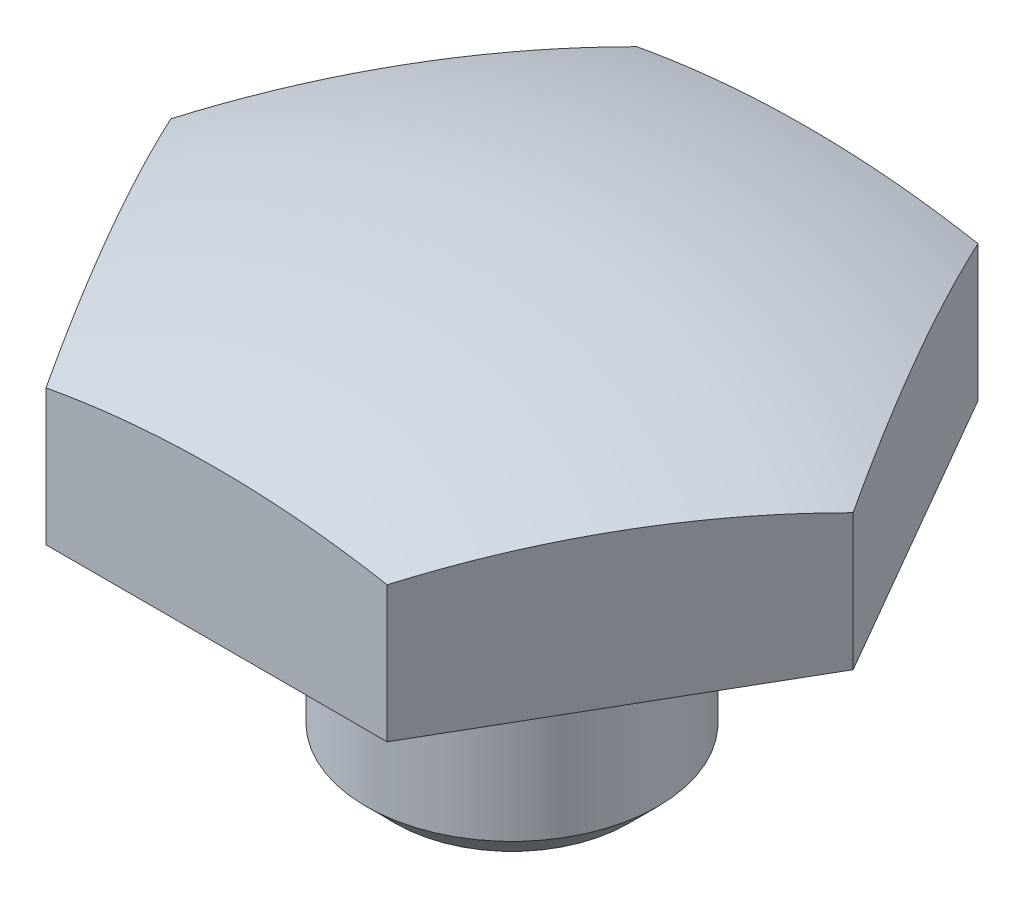
ISO-10303-21;
HEADER;
FILE_DESCRIPTION(('STEP AP214'),'2;1');
FILE_NAME('part.step','',(''),(''),'','','');
FILE_SCHEMA(('AUTOMOTIVE_DESIGN { 1 0 10303 214 1 1 1 1 }'));
ENDSEC;
DATA;
#1=APPLICATION_CONTEXT('core data for automotive mechanical design processes');
#2=APPLICATION_PROTOCOL_DEFINITION('international standard','automotive_design',2000,#1);
#3=PRODUCT_CONTEXT('',#1,'mechanical');
#4=PRODUCT('Part','Part','',(#3));
#5=PRODUCT_RELATED_PRODUCT_CATEGORY('part','',(#4));
#6=PRODUCT_DEFINITION_FORMATION('','',#4);
#7=PRODUCT_DEFINITION_CONTEXT('part definition',#1,'design');
#8=PRODUCT_DEFINITION('design','',#6,#7);
#9=PRODUCT_DEFINITION_SHAPE('','',#8);
#10=(LENGTH_UNIT() NAMED_UNIT(*) SI_UNIT(.MILLI.,.METRE.));
#11=(NAMED_UNIT(*) PLANE_ANGLE_UNIT() SI_UNIT($,.RADIAN.));
#12=(NAMED_UNIT(*) SI_UNIT($,.STERADIAN.) SOLID_ANGLE_UNIT());
#13=UNCERTAINTY_MEASURE_WITH_UNIT(LENGTH_MEASURE(1.E-05),#10,'distance_accuracy_value','');
#14=(GEOMETRIC_REPRESENTATION_CONTEXT(3) GLOBAL_UNCERTAINTY_ASSIGNED_CONTEXT((#13)) GLOBAL_UNIT_ASSIGNED_CONTEXT((#10,
#11,#12)) REPRESENTATION_CONTEXT('',''));
#15=CARTESIAN_POINT('',(0.,0.,0.));
#16=DIRECTION('',(0.,0.,1.));
#17=DIRECTION('',(1.,0.,0.));
#18=AXIS2_PLACEMENT_3D('',#15,#16,#17);
#19=CARTESIAN_POINT('',(0.,-17.4752,0.));
#20=DIRECTION('',(0.,-1.,0.));
#21=DIRECTION('',(1.,0.,0.));
#22=AXIS2_PLACEMENT_3D('',#19,#20,#21);
#23=SPHERICAL_SURFACE('',#22,31.75);
#24=CARTESIAN_POINT('',(-8.24889197104677,-17.4752,-4.7625));
#25=DIRECTION('',(0.866025403784438,0.,0.5));
#26=DIRECTION('',(0.5,0.,-0.866025403784439));
#27=AXIS2_PLACEMENT_3D('',#24,#25,#26);
#28=CIRCLE('',#27,30.287569644988);
#29=CARTESIAN_POINT('',(-10.9985226280624,12.3089410217097,0.));
#30=VERTEX_POINT('',#29);
#31=CARTESIAN_POINT('',(-5.49925618596528,12.3089410217097,-9.525));
#32=VERTEX_POINT('',#31);
#33=EDGE_CURVE('E106',#30,#32,#28,.F.);
#34=ORIENTED_EDGE('',*,*,#33,.F.);
#35=CARTESIAN_POINT('',(-8.24889197104677,-17.4752,4.7625));
#36=DIRECTION('',(0.866025403784438,0.,-0.5));
#37=DIRECTION('',(-0.5,0.,-0.866025403784439));
#38=AXIS2_PLACEMENT_3D('',#35,#36,#37);
#39=CIRCLE('',#38,30.287569644988);
#40=CARTESIAN_POINT('',(-5.49925618596528,12.3089419685407,9.525));
#41=VERTEX_POINT('',#40);
#42=EDGE_CURVE('E117',#41,#30,#39,.F.);
#43=ORIENTED_EDGE('',*,*,#42,.F.);
#44=CARTESIAN_POINT('',(0.,-17.4752,9.525));
#45=DIRECTION('',(0.,0.,-1.));
#46=DIRECTION('',(-1.,0.,0.));
#47=AXIS2_PLACEMENT_3D('',#44,#45,#46);
#48=CIRCLE('',#47,30.287569644988);
#49=CARTESIAN_POINT('',(5.49925618596535,12.3089410217098,9.525));
#50=VERTEX_POINT('',#49);
#51=EDGE_CURVE('E128',#50,#41,#48,.F.);
#52=ORIENTED_EDGE('',*,*,#51,.F.);
#53=CARTESIAN_POINT('',(8.24889197104678,-17.4752,4.7625));
#54=DIRECTION('',(-0.866025403784439,0.,-0.5));
#55=DIRECTION('',(-0.5,0.,0.866025403784439));
#56=AXIS2_PLACEMENT_3D('',#53,#54,#55);
#57=CIRCLE('',#56,30.287569644988);
#58=CARTESIAN_POINT('',(10.9985200640294,12.3089410217097,4.44103233875059E-06));
#59=VERTEX_POINT('',#58);
#60=EDGE_CURVE('E65',#59,#50,#57,.F.);
#61=ORIENTED_EDGE('',*,*,#60,.F.);
#62=CARTESIAN_POINT('',(8.24889197104678,-17.4752,-4.7625));
#63=DIRECTION('',(-0.866025403784438,0.,0.5));
#64=DIRECTION('',(0.5,0.,0.866025403784439));
#65=AXIS2_PLACEMENT_3D('',#62,#63,#64);
#66=CIRCLE('',#65,30.287569644988);
#67=CARTESIAN_POINT('',(5.49926387806151,12.3089410217097,-9.52499555896615));
#68=VERTEX_POINT('',#67);
#69=EDGE_CURVE('E222',#68,#59,#66,.F.);
#70=ORIENTED_EDGE('',*,*,#69,.F.);
#71=CARTESIAN_POINT('',(0.,-17.4752,-9.525));
#72=DIRECTION('',(0.,0.,1.));
#73=DIRECTION('',(1.,0.,0.));
#74=AXIS2_PLACEMENT_3D('',#71,#72,#73);
#75=CIRCLE('',#74,30.287569644988);
#76=EDGE_CURVE('E120',#32,#68,#75,.F.);
#77=ORIENTED_EDGE('',*,*,#76,.F.);
#78=EDGE_LOOP('',(#34,#43,#52,#61,#70,#77));
#79=FACE_BOUND('',#78,.T.);
#80=ADVANCED_FACE('F49',(#79),#23,.T.);
#81=CARTESIAN_POINT('',(0.,0.,0.));
#82=DIRECTION('',(0.,-1.,0.));
#83=DIRECTION('',(1.,0.,0.));
#84=AXIS2_PLACEMENT_3D('',#81,#82,#83);
#85=PLANE('',#84);
#86=CARTESIAN_POINT('',(0.,0.,0.));
#87=DIRECTION('',(0.,-1.,0.));
#88=DIRECTION('',(1.,0.,0.));
#89=AXIS2_PLACEMENT_3D('',#86,#87,#88);
#90=CIRCLE('',#89,3.74650000000001);
#91=CARTESIAN_POINT('',(3.74650000000001,0.,0.));
#92=VERTEX_POINT('',#91);
#93=EDGE_CURVE('E246',#92,#92,#90,.T.);
#94=ORIENTED_EDGE('',*,*,#93,.T.);
#95=EDGE_LOOP('',(#94));
#96=FACE_BOUND('',#95,.T.);
#97=ADVANCED_FACE('F300',(#96),#85,.T.);
#98=CARTESIAN_POINT('',(0.,0.,0.));
#99=DIRECTION('',(0.,1.,0.));
#100=DIRECTION('',(-1.,0.,0.));
#101=AXIS2_PLACEMENT_3D('',#98,#99,#100);
#102=CONICAL_SURFACE('',#101,3.74650000000001,0.785398163397609);
#103=CARTESIAN_POINT('',(0.,0.95249999999969,0.));
#104=DIRECTION('',(0.,-1.,0.));
#105=DIRECTION('',(1.,0.,0.));
#106=AXIS2_PLACEMENT_3D('',#103,#104,#105);
#107=CIRCLE('',#106,4.699);
#108=CARTESIAN_POINT('',(4.699,0.952499999999706,0.));
#109=VERTEX_POINT('',#108);
#110=EDGE_CURVE('E243',#109,#109,#107,.T.);
#111=ORIENTED_EDGE('',*,*,#110,.T.);
#112=EDGE_LOOP('',(#111));
#113=FACE_BOUND('',#112,.T.);
#114=ORIENTED_EDGE('',*,*,#93,.F.);
#115=EDGE_LOOP('',(#114));
#116=FACE_BOUND('',#115,.T.);
#117=ADVANCED_FACE('F304',(#113,#116),#102,.T.);
#118=CARTESIAN_POINT('',(3.49148133884313E-12,-1000.,0.));
#119=DIRECTION('',(0.,-1.,0.));
#120=DIRECTION('',(1.,0.,0.));
#121=AXIS2_PLACEMENT_3D('',#118,#119,#120);
#122=CYLINDRICAL_SURFACE('',#121,4.69900000000001);
#123=CARTESIAN_POINT('',(0.,4.99110000000025,0.));
#124=DIRECTION('',(0.,-1.,0.));
#125=DIRECTION('',(1.,0.,0.));
#126=AXIS2_PLACEMENT_3D('',#123,#124,#125);
#127=CIRCLE('',#126,4.69900000000002);
#128=CARTESIAN_POINT('',(4.699,4.99110000000026,0.));
#129=VERTEX_POINT('',#128);
#130=EDGE_CURVE('E240',#129,#129,#127,.T.);
#131=ORIENTED_EDGE('',*,*,#130,.T.);
#132=EDGE_LOOP('',(#131));
#133=FACE_BOUND('',#132,.T.);
#134=ORIENTED_EDGE('',*,*,#110,.F.);
#135=EDGE_LOOP('',(#134));
#136=FACE_BOUND('',#135,.T.);
#137=ADVANCED_FACE('F308',(#133,#136),#122,.T.);
#138=CARTESIAN_POINT('',(0.,4.99110000000025,0.));
#139=DIRECTION('',(0.,-1.,0.));
#140=DIRECTION('',(1.,0.,0.));
#141=AXIS2_PLACEMENT_3D('',#138,#139,#140);
#142=CONICAL_SURFACE('',#141,4.69900000000002,0.78539816339761);
#143=CARTESIAN_POINT('',(0.,5.94359999999994,0.));
#144=DIRECTION('',(0.,-1.,0.));
#145=DIRECTION('',(1.,0.,0.));
#146=AXIS2_PLACEMENT_3D('',#143,#144,#145);
#147=CIRCLE('',#146,3.74650000000002);
#148=CARTESIAN_POINT('',(3.7465,5.94359999999995,0.));
#149=VERTEX_POINT('',#148);
#150=EDGE_CURVE('E231',#149,#149,#147,.T.);
#151=ORIENTED_EDGE('',*,*,#150,.T.);
#152=EDGE_LOOP('',(#151));
#153=FACE_BOUND('',#152,.T.);
#154=ORIENTED_EDGE('',*,*,#130,.F.);
#155=EDGE_LOOP('',(#154));
#156=FACE_BOUND('',#155,.T.);
#157=ADVANCED_FACE('F314',(#153,#156),#142,.T.);
#158=CARTESIAN_POINT('',(3.49148133884313E-12,-1000.,0.));
#159=DIRECTION('',(0.,-1.,0.));
#160=DIRECTION('',(1.,0.,0.));
#161=AXIS2_PLACEMENT_3D('',#158,#159,#160);
#162=CYLINDRICAL_SURFACE('',#161,3.74650000000002);
#163=CARTESIAN_POINT('',(0.,7.5438000000001,0.));
#164=DIRECTION('',(0.,-1.,0.));
#165=DIRECTION('',(1.,0.,0.));
#166=AXIS2_PLACEMENT_3D('',#163,#164,#165);
#167=CIRCLE('',#166,3.74650000000003);
#168=CARTESIAN_POINT('',(3.7465,7.54380000000011,0.));
#169=VERTEX_POINT('',#168);
#170=EDGE_CURVE('E226',#169,#169,#167,.T.);
#171=ORIENTED_EDGE('',*,*,#170,.T.);
#172=EDGE_LOOP('',(#171));
#173=FACE_BOUND('',#172,.T.);
#174=ORIENTED_EDGE('',*,*,#150,.F.);
#175=EDGE_LOOP('',(#174));
#176=FACE_BOUND('',#175,.T.);
#177=ADVANCED_FACE('F318',(#173,#176),#162,.T.);
#178=CARTESIAN_POINT('',(0.,7.5438,0.));
#179=DIRECTION('',(0.,-1.,0.));
#180=DIRECTION('',(1.,0.,0.));
#181=AXIS2_PLACEMENT_3D('',#178,#179,#180);
#182=TOROIDAL_SURFACE('',#181,4.12750000000003,0.381);
#183=CARTESIAN_POINT('',(0.,7.92480000000007,0.));
#184=DIRECTION('',(0.,-1.,0.));
#185=DIRECTION('',(1.,0.,0.));
#186=AXIS2_PLACEMENT_3D('',#183,#184,#185);
#187=CIRCLE('',#186,4.12750000000003);
#188=CARTESIAN_POINT('',(4.1275,7.92480000000008,0.));
#189=VERTEX_POINT('',#188);
#190=EDGE_CURVE('E224',#189,#189,#187,.T.);
#191=ORIENTED_EDGE('',*,*,#190,.T.);
#192=EDGE_LOOP('',(#191));
#193=FACE_BOUND('',#192,.T.);
#194=ORIENTED_EDGE('',*,*,#170,.F.);
#195=EDGE_LOOP('',(#194));
#196=FACE_BOUND('',#195,.T.);
#197=ADVANCED_FACE('F322',(#193,#196),#182,.F.);
#198=CARTESIAN_POINT('',(10.9985175,7.92480000000001,0.));
#199=DIRECTION('',(0.,-1.,0.));
#200=DIRECTION('',(1.,0.,0.));
#201=AXIS2_PLACEMENT_3D('',#198,#199,#200);
#202=PLANE('',#201);
#203=DIRECTION('',(-0.5,0.,0.866025403784439));
#204=VECTOR('',#203,1.);
#205=CARTESIAN_POINT('',(-5.49926259604677,7.92479999999996,-9.52499777948386));
#206=LINE('',#205,#204);
#207=CARTESIAN_POINT('',(-5.49926131403118,7.92479999999999,-9.525));
#208=VERTEX_POINT('',#207);
#209=CARTESIAN_POINT('',(-10.9985226280624,7.92480000000002,0.));
#210=VERTEX_POINT('',#209);
#211=EDGE_CURVE('E109',#208,#210,#206,.T.);
#212=ORIENTED_EDGE('',*,*,#211,.F.);
#213=DIRECTION('',(1.,0.,0.));
#214=VECTOR('',#213,1.);
#215=CARTESIAN_POINT('',(0.,7.92479999999999,-9.525));
#216=LINE('',#215,#214);
#217=CARTESIAN_POINT('',(5.49926131403119,7.92480000000001,-9.525));
#218=VERTEX_POINT('',#217);
#219=EDGE_CURVE('E259',#218,#208,#216,.F.);
#220=ORIENTED_EDGE('',*,*,#219,.F.);
#221=DIRECTION('',(0.5,0.,0.866025403784439));
#222=VECTOR('',#221,1.);
#223=CARTESIAN_POINT('',(8.24889197104678,7.92480000000001,-4.76250000000001));
#224=LINE('',#223,#222);
#225=CARTESIAN_POINT('',(10.9985226280624,7.92479999999999,0.));
#226=VERTEX_POINT('',#225);
#227=EDGE_CURVE('E194',#226,#218,#224,.F.);
#228=ORIENTED_EDGE('',*,*,#227,.F.);
#229=DIRECTION('',(-0.5,0.,0.866025403784439));
#230=VECTOR('',#229,1.);
#231=CARTESIAN_POINT('',(8.24889197104678,7.92479999999999,4.7625));
#232=LINE('',#231,#230);
#233=CARTESIAN_POINT('',(5.49926131403119,7.92479999999996,9.525));
#234=VERTEX_POINT('',#233);
#235=EDGE_CURVE('E177',#234,#226,#232,.F.);
#236=ORIENTED_EDGE('',*,*,#235,.F.);
#237=DIRECTION('',(-1.,0.,0.));
#238=VECTOR('',#237,1.);
#239=CARTESIAN_POINT('',(0.,7.92479999999996,9.525));
#240=LINE('',#239,#238);
#241=CARTESIAN_POINT('',(-5.49925618596528,7.92479999999994,9.52499999999999));
#242=VERTEX_POINT('',#241);
#243=EDGE_CURVE('E125',#242,#234,#240,.F.);
#244=ORIENTED_EDGE('',*,*,#243,.F.);
#245=DIRECTION('',(-0.5,0.,-0.866025403784439));
#246=VECTOR('',#245,1.);
#247=CARTESIAN_POINT('',(-8.24889197104677,7.92479999999993,4.7625));
#248=LINE('',#247,#246);
#249=EDGE_CURVE('E73',#210,#242,#248,.F.);
#250=ORIENTED_EDGE('',*,*,#249,.F.);
#251=EDGE_LOOP('',(#212,#220,#228,#236,#244,#250));
#252=FACE_BOUND('',#251,.T.);
#253=ORIENTED_EDGE('',*,*,#190,.F.);
#254=EDGE_LOOP('',(#253));
#255=FACE_BOUND('',#254,.T.);
#256=ADVANCED_FACE('F255',(#252,#255),#202,.T.);
#257=CARTESIAN_POINT('',(0.,14.2748,9.525));
#258=DIRECTION('',(0.,0.,-1.));
#259=DIRECTION('',(-1.,0.,0.));
#260=AXIS2_PLACEMENT_3D('',#257,#258,#259);
#261=PLANE('',#260);
#262=CARTESIAN_POINT('',(5.49926131403119,12.3089410217098,9.525));
#263=DIRECTION('',(0.,-1.,0.));
#264=VECTOR('',#263,1.);
#265=LINE('',#262,#264);
#266=EDGE_CURVE('E12',#50,#234,#265,.T.);
#267=ORIENTED_EDGE('',*,*,#266,.F.);
#268=ORIENTED_EDGE('',*,*,#51,.T.);
#269=CARTESIAN_POINT('',(-5.49925105789939,12.3089419685409,9.525));
#270=DIRECTION('',(0.,-1.,0.));
#271=VECTOR('',#270,1.);
#272=LINE('',#269,#271);
#273=EDGE_CURVE('E59',#41,#242,#272,.T.);
#274=ORIENTED_EDGE('',*,*,#273,.T.);
#275=ORIENTED_EDGE('',*,*,#243,.T.);
#276=EDGE_LOOP('',(#267,#268,#274,#275));
#277=FACE_BOUND('',#276,.T.);
#278=ADVANCED_FACE('F153',(#277),#261,.F.);
#279=CARTESIAN_POINT('',(-8.24889197104677,14.2748,4.7625));
#280=DIRECTION('',(0.866025403784438,0.,-0.5));
#281=DIRECTION('',(-0.5,0.,-0.866025403784439));
#282=AXIS2_PLACEMENT_3D('',#279,#280,#281);
#283=PLANE('',#282);
#284=ORIENTED_EDGE('',*,*,#42,.T.);
#285=CARTESIAN_POINT('',(-10.9985174999938,12.3089419685407,8.88207522375256E-06));
#286=DIRECTION('',(0.,-1.,0.));
#287=VECTOR('',#286,1.);
#288=LINE('',#285,#287);
#289=EDGE_CURVE('E103',#30,#210,#288,.T.);
#290=ORIENTED_EDGE('',*,*,#289,.T.);
#291=ORIENTED_EDGE('',*,*,#249,.T.);
#292=ORIENTED_EDGE('',*,*,#273,.F.);
#293=EDGE_LOOP('',(#284,#290,#291,#292));
#294=FACE_BOUND('',#293,.T.);
#295=ADVANCED_FACE('F123',(#294),#283,.F.);
#296=CARTESIAN_POINT('',(8.24889197104678,14.2748,4.7625));
#297=DIRECTION('',(-0.866025403784439,0.,-0.5));
#298=DIRECTION('',(-0.5,0.,0.866025403784439));
#299=AXIS2_PLACEMENT_3D('',#296,#297,#298);
#300=PLANE('',#299);
#301=ORIENTED_EDGE('',*,*,#60,.T.);
#302=ORIENTED_EDGE('',*,*,#266,.T.);
#303=ORIENTED_EDGE('',*,*,#235,.T.);
#304=CARTESIAN_POINT('',(10.9985226280624,12.3089410217097,0.));
#305=DIRECTION('',(0.,-1.,0.));
#306=VECTOR('',#305,1.);
#307=LINE('',#304,#306);
#308=EDGE_CURVE('E184',#59,#226,#307,.T.);
#309=ORIENTED_EDGE('',*,*,#308,.F.);
#310=EDGE_LOOP('',(#301,#302,#303,#309));
#311=FACE_BOUND('',#310,.T.);
#312=ADVANCED_FACE('F152',(#311),#300,.F.);
#313=CARTESIAN_POINT('',(8.24889197104678,14.2748,-4.76250000000001));
#314=DIRECTION('',(-0.866025403784438,0.,0.5));
#315=DIRECTION('',(0.5,0.,0.866025403784439));
#316=AXIS2_PLACEMENT_3D('',#313,#314,#315);
#317=PLANE('',#316);
#318=ORIENTED_EDGE('',*,*,#69,.T.);
#319=ORIENTED_EDGE('',*,*,#308,.T.);
#320=ORIENTED_EDGE('',*,*,#227,.T.);
#321=CARTESIAN_POINT('',(5.49926131403119,12.3089410217097,-9.525));
#322=DIRECTION('',(0.,-1.,0.));
#323=VECTOR('',#322,1.);
#324=LINE('',#321,#323);
#325=EDGE_CURVE('E260',#68,#218,#324,.T.);
#326=ORIENTED_EDGE('',*,*,#325,.F.);
#327=EDGE_LOOP('',(#318,#319,#320,#326));
#328=FACE_BOUND('',#327,.T.);
#329=ADVANCED_FACE('F196',(#328),#317,.F.);
#330=CARTESIAN_POINT('',(0.,14.2748,-9.525));
#331=DIRECTION('',(0.,0.,1.));
#332=DIRECTION('',(1.,0.,0.));
#333=AXIS2_PLACEMENT_3D('',#330,#331,#332);
#334=PLANE('',#333);
#335=ORIENTED_EDGE('',*,*,#76,.T.);
#336=ORIENTED_EDGE('',*,*,#325,.T.);
#337=ORIENTED_EDGE('',*,*,#219,.T.);
#338=CARTESIAN_POINT('',(-5.49926131403118,12.3089410217097,-9.525));
#339=DIRECTION('',(0.,-1.,0.));
#340=VECTOR('',#339,1.);
#341=LINE('',#338,#340);
#342=EDGE_CURVE('E121',#32,#208,#341,.T.);
#343=ORIENTED_EDGE('',*,*,#342,.F.);
#344=EDGE_LOOP('',(#335,#336,#337,#343));
#345=FACE_BOUND('',#344,.T.);
#346=ADVANCED_FACE('F205',(#345),#334,.F.);
#347=CARTESIAN_POINT('',(-8.24889197104677,14.2748,-4.7625));
#348=DIRECTION('',(0.866025403784438,0.,0.5));
#349=DIRECTION('',(0.5,0.,-0.866025403784439));
#350=AXIS2_PLACEMENT_3D('',#347,#348,#349);
#351=PLANE('',#350);
#352=ORIENTED_EDGE('',*,*,#33,.T.);
#353=ORIENTED_EDGE('',*,*,#342,.T.);
#354=ORIENTED_EDGE('',*,*,#211,.T.);
#355=ORIENTED_EDGE('',*,*,#289,.F.);
#356=EDGE_LOOP('',(#352,#353,#354,#355));
#357=FACE_BOUND('',#356,.T.);
#358=ADVANCED_FACE('F105',(#357),#351,.F.);
#359=CLOSED_SHELL('',(#80,#97,#117,#137,#157,#177,#197,#256,#278,#295,#312,#329,#346,#358));
#360=MANIFOLD_SOLID_BREP('B2',#359);
#361=ADVANCED_BREP_SHAPE_REPRESENTATION('',(#18,#360),#14);
#362=SHAPE_DEFINITION_REPRESENTATION(#9,#361);
ENDSEC;
END-ISO-10303-21;
